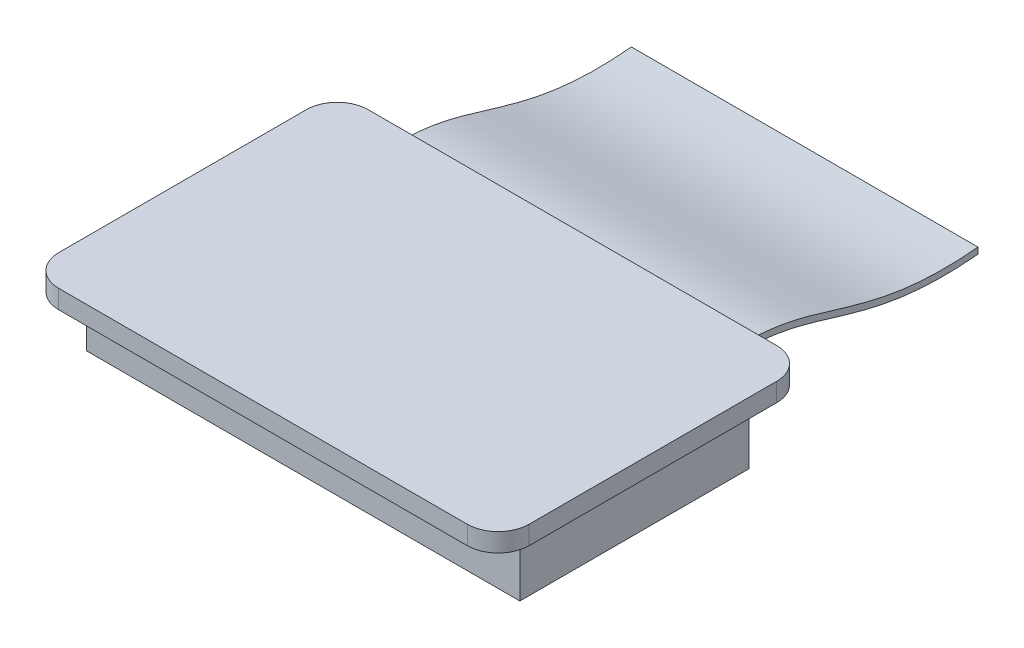
ISO-10303-21;
HEADER;
FILE_DESCRIPTION(('STEP AP214'),'2;1');
FILE_NAME('part.step','',(''),(''),'','','');
FILE_SCHEMA(('AUTOMOTIVE_DESIGN { 1 0 10303 214 1 1 1 1 }'));
ENDSEC;
DATA;
#1=APPLICATION_CONTEXT('core data for automotive mechanical design processes');
#2=APPLICATION_PROTOCOL_DEFINITION('international standard','automotive_design',2000,#1);
#3=PRODUCT_CONTEXT('',#1,'mechanical');
#4=PRODUCT('Part','Part','',(#3));
#5=PRODUCT_RELATED_PRODUCT_CATEGORY('part','',(#4));
#6=PRODUCT_DEFINITION_FORMATION('','',#4);
#7=PRODUCT_DEFINITION_CONTEXT('part definition',#1,'design');
#8=PRODUCT_DEFINITION('design','',#6,#7);
#9=PRODUCT_DEFINITION_SHAPE('','',#8);
#10=(LENGTH_UNIT() NAMED_UNIT(*) SI_UNIT(.MILLI.,.METRE.));
#11=(NAMED_UNIT(*) PLANE_ANGLE_UNIT() SI_UNIT($,.RADIAN.));
#12=(NAMED_UNIT(*) SI_UNIT($,.STERADIAN.) SOLID_ANGLE_UNIT());
#13=UNCERTAINTY_MEASURE_WITH_UNIT(LENGTH_MEASURE(1.E-05),#10,'distance_accuracy_value','');
#14=(GEOMETRIC_REPRESENTATION_CONTEXT(3) GLOBAL_UNCERTAINTY_ASSIGNED_CONTEXT((#13)) GLOBAL_UNIT_ASSIGNED_CONTEXT((#10,
#11,#12)) REPRESENTATION_CONTEXT('',''));
#15=CARTESIAN_POINT('',(0.,0.,0.));
#16=DIRECTION('',(0.,0.,1.));
#17=DIRECTION('',(1.,0.,0.));
#18=AXIS2_PLACEMENT_3D('',#15,#16,#17);
#19=CARTESIAN_POINT('',(3.3,0.748301222298696,8.25169585037883));
#20=DIRECTION('',(0.,-1.,0.));
#21=DIRECTION('',(0.,0.,-1.));
#22=AXIS2_PLACEMENT_3D('',#19,#20,#21);
#23=CYLINDRICAL_SURFACE('',#22,0.5);
#24=CARTESIAN_POINT('',(3.3,0.448301222298696,8.25169585037883));
#25=DIRECTION('',(0.,-1.,0.));
#26=DIRECTION('',(0.,0.,-1.));
#27=AXIS2_PLACEMENT_3D('',#24,#25,#26);
#28=CIRCLE('',#27,0.5);
#29=CARTESIAN_POINT('',(3.3,0.448301222298696,7.75169585037883));
#30=VERTEX_POINT('',#29);
#31=CARTESIAN_POINT('',(3.8,0.448301222298696,8.25169585037883));
#32=VERTEX_POINT('',#31);
#33=EDGE_CURVE('E170',#30,#32,#28,.T.);
#34=ORIENTED_EDGE('',*,*,#33,.F.);
#35=DIRECTION('',(0.,-1.,0.));
#36=VECTOR('',#35,1.);
#37=CARTESIAN_POINT('',(3.3,0.748301222298696,7.75169585037883));
#38=LINE('',#37,#36);
#39=CARTESIAN_POINT('',(3.3,0.748301222298696,7.75169585037883));
#40=VERTEX_POINT('',#39);
#41=EDGE_CURVE('E13',#40,#30,#38,.T.);
#42=ORIENTED_EDGE('',*,*,#41,.F.);
#43=CARTESIAN_POINT('',(3.3,0.748301222298696,8.25169585037883));
#44=DIRECTION('',(0.,-1.,0.));
#45=DIRECTION('',(0.,0.,-1.));
#46=AXIS2_PLACEMENT_3D('',#43,#44,#45);
#47=CIRCLE('',#46,0.5);
#48=CARTESIAN_POINT('',(3.8,0.748301222298696,8.25169585037883));
#49=VERTEX_POINT('',#48);
#50=EDGE_CURVE('E191',#40,#49,#47,.T.);
#51=ORIENTED_EDGE('',*,*,#50,.T.);
#52=DIRECTION('',(0.,-1.,0.));
#53=VECTOR('',#52,1.);
#54=CARTESIAN_POINT('',(3.8,0.748301222298696,8.25169585037883));
#55=LINE('',#54,#53);
#56=EDGE_CURVE('E63',#49,#32,#55,.T.);
#57=ORIENTED_EDGE('',*,*,#56,.T.);
#58=EDGE_LOOP('',(#34,#42,#51,#57));
#59=FACE_BOUND('',#58,.T.);
#60=ADVANCED_FACE('F60',(#59),#23,.T.);
#61=CARTESIAN_POINT('',(-3.3,0.748301222298696,7.75169585037883));
#62=DIRECTION('',(0.,0.,-1.));
#63=DIRECTION('',(-1.,0.,0.));
#64=AXIS2_PLACEMENT_3D('',#61,#62,#63);
#65=PLANE('',#64);
#66=DIRECTION('',(1.,0.,0.));
#67=VECTOR('',#66,1.);
#68=CARTESIAN_POINT('',(-3.3,0.448301222298696,7.75169585037883));
#69=LINE('',#68,#67);
#70=CARTESIAN_POINT('',(-3.3,0.448301222298696,7.75169585037883));
#71=VERTEX_POINT('',#70);
#72=EDGE_CURVE('E189',#71,#30,#69,.T.);
#73=ORIENTED_EDGE('',*,*,#72,.F.);
#74=DIRECTION('',(0.,-1.,0.));
#75=VECTOR('',#74,1.);
#76=CARTESIAN_POINT('',(-3.3,0.748301222298696,7.75169585037883));
#77=LINE('',#76,#75);
#78=CARTESIAN_POINT('',(-3.3,0.748301222298696,7.75169585037883));
#79=VERTEX_POINT('',#78);
#80=EDGE_CURVE('E68',#79,#71,#77,.T.);
#81=ORIENTED_EDGE('',*,*,#80,.F.);
#82=DIRECTION('',(1.,0.,0.));
#83=VECTOR('',#82,1.);
#84=CARTESIAN_POINT('',(-3.3,0.748301222298696,7.75169585037883));
#85=LINE('',#84,#83);
#86=EDGE_CURVE('E160',#79,#40,#85,.T.);
#87=ORIENTED_EDGE('',*,*,#86,.T.);
#88=ORIENTED_EDGE('',*,*,#41,.T.);
#89=EDGE_LOOP('',(#73,#81,#87,#88));
#90=FACE_BOUND('',#89,.T.);
#91=ADVANCED_FACE('F203',(#90),#65,.T.);
#92=CARTESIAN_POINT('',(-3.3,0.748301222298696,8.25169585037883));
#93=DIRECTION('',(0.,-1.,0.));
#94=DIRECTION('',(0.,0.,-1.));
#95=AXIS2_PLACEMENT_3D('',#92,#93,#94);
#96=CYLINDRICAL_SURFACE('',#95,0.5);
#97=CARTESIAN_POINT('',(-3.3,0.448301222298696,8.25169585037883));
#98=DIRECTION('',(0.,-1.,0.));
#99=DIRECTION('',(0.,0.,-1.));
#100=AXIS2_PLACEMENT_3D('',#97,#98,#99);
#101=CIRCLE('',#100,0.5);
#102=CARTESIAN_POINT('',(-3.8,0.448301222298696,8.25169585037883));
#103=VERTEX_POINT('',#102);
#104=EDGE_CURVE('E147',#103,#71,#101,.T.);
#105=ORIENTED_EDGE('',*,*,#104,.F.);
#106=DIRECTION('',(0.,-1.,0.));
#107=VECTOR('',#106,1.);
#108=CARTESIAN_POINT('',(-3.8,0.748301222298696,8.25169585037883));
#109=LINE('',#108,#107);
#110=CARTESIAN_POINT('',(-3.8,0.748301222298696,8.25169585037883));
#111=VERTEX_POINT('',#110);
#112=EDGE_CURVE('E141',#111,#103,#109,.T.);
#113=ORIENTED_EDGE('',*,*,#112,.F.);
#114=CARTESIAN_POINT('',(-3.3,0.748301222298696,8.25169585037883));
#115=DIRECTION('',(0.,-1.,0.));
#116=DIRECTION('',(0.,0.,-1.));
#117=AXIS2_PLACEMENT_3D('',#114,#115,#116);
#118=CIRCLE('',#117,0.5);
#119=EDGE_CURVE('E144',#111,#79,#118,.T.);
#120=ORIENTED_EDGE('',*,*,#119,.T.);
#121=ORIENTED_EDGE('',*,*,#80,.T.);
#122=EDGE_LOOP('',(#105,#113,#120,#121));
#123=FACE_BOUND('',#122,.T.);
#124=ADVANCED_FACE('F143',(#123),#96,.T.);
#125=CARTESIAN_POINT('',(-3.8,0.748301222298696,12.2516958503788));
#126=DIRECTION('',(-1.,0.,0.));
#127=DIRECTION('',(0.,0.,1.));
#128=AXIS2_PLACEMENT_3D('',#125,#126,#127);
#129=PLANE('',#128);
#130=DIRECTION('',(0.,0.,-1.));
#131=VECTOR('',#130,1.);
#132=CARTESIAN_POINT('',(-3.8,0.448301222298696,12.2516958503788));
#133=LINE('',#132,#131);
#134=CARTESIAN_POINT('',(-3.8,0.448301222298696,12.2516958503788));
#135=VERTEX_POINT('',#134);
#136=EDGE_CURVE('E186',#135,#103,#133,.T.);
#137=ORIENTED_EDGE('',*,*,#136,.F.);
#138=DIRECTION('',(0.,-1.,0.));
#139=VECTOR('',#138,1.);
#140=CARTESIAN_POINT('',(-3.8,0.748301222298696,12.2516958503788));
#141=LINE('',#140,#139);
#142=CARTESIAN_POINT('',(-3.8,0.748301222298696,12.2516958503788));
#143=VERTEX_POINT('',#142);
#144=EDGE_CURVE('E152',#143,#135,#141,.T.);
#145=ORIENTED_EDGE('',*,*,#144,.F.);
#146=DIRECTION('',(0.,0.,-1.));
#147=VECTOR('',#146,1.);
#148=CARTESIAN_POINT('',(-3.8,0.748301222298696,12.2516958503788));
#149=LINE('',#148,#147);
#150=EDGE_CURVE('E158',#143,#111,#149,.T.);
#151=ORIENTED_EDGE('',*,*,#150,.T.);
#152=ORIENTED_EDGE('',*,*,#112,.T.);
#153=EDGE_LOOP('',(#137,#145,#151,#152));
#154=FACE_BOUND('',#153,.T.);
#155=ADVANCED_FACE('F162',(#154),#129,.T.);
#156=CARTESIAN_POINT('',(-3.3,0.748301222298696,12.2516958503788));
#157=DIRECTION('',(0.,-1.,0.));
#158=DIRECTION('',(0.,0.,-1.));
#159=AXIS2_PLACEMENT_3D('',#156,#157,#158);
#160=CYLINDRICAL_SURFACE('',#159,0.5);
#161=CARTESIAN_POINT('',(-3.3,0.448301222298696,12.2516958503788));
#162=DIRECTION('',(0.,-1.,0.));
#163=DIRECTION('',(0.,0.,-1.));
#164=AXIS2_PLACEMENT_3D('',#161,#162,#163);
#165=CIRCLE('',#164,0.5);
#166=CARTESIAN_POINT('',(-3.3,0.448301222298696,12.7516958503788));
#167=VERTEX_POINT('',#166);
#168=EDGE_CURVE('E183',#167,#135,#165,.T.);
#169=ORIENTED_EDGE('',*,*,#168,.F.);
#170=DIRECTION('',(0.,-1.,0.));
#171=VECTOR('',#170,1.);
#172=CARTESIAN_POINT('',(-3.3,0.748301222298696,12.7516958503788));
#173=LINE('',#172,#171);
#174=CARTESIAN_POINT('',(-3.3,0.748301222298696,12.7516958503788));
#175=VERTEX_POINT('',#174);
#176=EDGE_CURVE('E195',#175,#167,#173,.T.);
#177=ORIENTED_EDGE('',*,*,#176,.F.);
#178=CARTESIAN_POINT('',(-3.3,0.748301222298696,12.2516958503788));
#179=DIRECTION('',(0.,-1.,0.));
#180=DIRECTION('',(0.,0.,-1.));
#181=AXIS2_PLACEMENT_3D('',#178,#179,#180);
#182=CIRCLE('',#181,0.5);
#183=EDGE_CURVE('E163',#175,#143,#182,.T.);
#184=ORIENTED_EDGE('',*,*,#183,.T.);
#185=ORIENTED_EDGE('',*,*,#144,.T.);
#186=EDGE_LOOP('',(#169,#177,#184,#185));
#187=FACE_BOUND('',#186,.T.);
#188=ADVANCED_FACE('F216',(#187),#160,.T.);
#189=CARTESIAN_POINT('',(-3.3,0.748301222298696,12.7516958503788));
#190=DIRECTION('',(0.,0.,1.));
#191=DIRECTION('',(1.,0.,0.));
#192=AXIS2_PLACEMENT_3D('',#189,#190,#191);
#193=PLANE('',#192);
#194=DIRECTION('',(-1.,0.,0.));
#195=VECTOR('',#194,1.);
#196=CARTESIAN_POINT('',(-3.3,0.448301222298696,12.7516958503788));
#197=LINE('',#196,#195);
#198=CARTESIAN_POINT('',(3.3,0.448301222298696,12.7516958503788));
#199=VERTEX_POINT('',#198);
#200=EDGE_CURVE('E180',#199,#167,#197,.T.);
#201=ORIENTED_EDGE('',*,*,#200,.F.);
#202=DIRECTION('',(0.,-1.,0.));
#203=VECTOR('',#202,1.);
#204=CARTESIAN_POINT('',(3.3,0.748301222298696,12.7516958503788));
#205=LINE('',#204,#203);
#206=CARTESIAN_POINT('',(3.3,0.748301222298696,12.7516958503788));
#207=VERTEX_POINT('',#206);
#208=EDGE_CURVE('E197',#207,#199,#205,.T.);
#209=ORIENTED_EDGE('',*,*,#208,.F.);
#210=DIRECTION('',(-1.,0.,0.));
#211=VECTOR('',#210,1.);
#212=CARTESIAN_POINT('',(-3.3,0.748301222298696,12.7516958503788));
#213=LINE('',#212,#211);
#214=EDGE_CURVE('E165',#207,#175,#213,.T.);
#215=ORIENTED_EDGE('',*,*,#214,.T.);
#216=ORIENTED_EDGE('',*,*,#176,.T.);
#217=EDGE_LOOP('',(#201,#209,#215,#216));
#218=FACE_BOUND('',#217,.T.);
#219=ADVANCED_FACE('F219',(#218),#193,.T.);
#220=CARTESIAN_POINT('',(3.3,0.748301222298696,12.2516958503788));
#221=DIRECTION('',(0.,-1.,0.));
#222=DIRECTION('',(0.,0.,-1.));
#223=AXIS2_PLACEMENT_3D('',#220,#221,#222);
#224=CYLINDRICAL_SURFACE('',#223,0.5);
#225=CARTESIAN_POINT('',(3.3,0.448301222298696,12.2516958503788));
#226=DIRECTION('',(0.,-1.,0.));
#227=DIRECTION('',(0.,0.,1.));
#228=AXIS2_PLACEMENT_3D('',#225,#226,#227);
#229=CIRCLE('',#228,0.5);
#230=CARTESIAN_POINT('',(3.8,0.448301222298696,12.2516958503788));
#231=VERTEX_POINT('',#230);
#232=EDGE_CURVE('E177',#231,#199,#229,.T.);
#233=ORIENTED_EDGE('',*,*,#232,.F.);
#234=DIRECTION('',(0.,-1.,0.));
#235=VECTOR('',#234,1.);
#236=CARTESIAN_POINT('',(3.8,0.748301222298696,12.2516958503788));
#237=LINE('',#236,#235);
#238=CARTESIAN_POINT('',(3.8,0.748301222298696,12.2516958503788));
#239=VERTEX_POINT('',#238);
#240=EDGE_CURVE('E198',#239,#231,#237,.T.);
#241=ORIENTED_EDGE('',*,*,#240,.F.);
#242=CARTESIAN_POINT('',(3.3,0.748301222298696,12.2516958503788));
#243=DIRECTION('',(0.,-1.,0.));
#244=DIRECTION('',(0.,0.,1.));
#245=AXIS2_PLACEMENT_3D('',#242,#243,#244);
#246=CIRCLE('',#245,0.5);
#247=EDGE_CURVE('E287',#239,#207,#246,.T.);
#248=ORIENTED_EDGE('',*,*,#247,.T.);
#249=ORIENTED_EDGE('',*,*,#208,.T.);
#250=EDGE_LOOP('',(#233,#241,#248,#249));
#251=FACE_BOUND('',#250,.T.);
#252=ADVANCED_FACE('F223',(#251),#224,.T.);
#253=CARTESIAN_POINT('',(3.8,0.748301222298696,12.2516958503788));
#254=DIRECTION('',(1.,0.,0.));
#255=DIRECTION('',(0.,0.,-1.));
#256=AXIS2_PLACEMENT_3D('',#253,#254,#255);
#257=PLANE('',#256);
#258=DIRECTION('',(0.,0.,1.));
#259=VECTOR('',#258,1.);
#260=CARTESIAN_POINT('',(3.8,0.448301222298696,12.2516958503788));
#261=LINE('',#260,#259);
#262=EDGE_CURVE('E173',#32,#231,#261,.T.);
#263=ORIENTED_EDGE('',*,*,#262,.F.);
#264=ORIENTED_EDGE('',*,*,#56,.F.);
#265=DIRECTION('',(0.,0.,1.));
#266=VECTOR('',#265,1.);
#267=CARTESIAN_POINT('',(3.8,0.748301222298696,12.2516958503788));
#268=LINE('',#267,#266);
#269=EDGE_CURVE('E285',#49,#239,#268,.T.);
#270=ORIENTED_EDGE('',*,*,#269,.T.);
#271=ORIENTED_EDGE('',*,*,#240,.T.);
#272=EDGE_LOOP('',(#263,#264,#270,#271));
#273=FACE_BOUND('',#272,.T.);
#274=ADVANCED_FACE('F200',(#273),#257,.T.);
#275=CARTESIAN_POINT('',(3.3,0.748301222298696,8.25169585037883));
#276=DIRECTION('',(0.,-1.,0.));
#277=DIRECTION('',(0.,0.,-1.));
#278=AXIS2_PLACEMENT_3D('',#275,#276,#277);
#279=PLANE('',#278);
#280=ORIENTED_EDGE('',*,*,#50,.F.);
#281=ORIENTED_EDGE('',*,*,#86,.F.);
#282=ORIENTED_EDGE('',*,*,#119,.F.);
#283=ORIENTED_EDGE('',*,*,#150,.F.);
#284=ORIENTED_EDGE('',*,*,#183,.F.);
#285=ORIENTED_EDGE('',*,*,#214,.F.);
#286=ORIENTED_EDGE('',*,*,#247,.F.);
#287=ORIENTED_EDGE('',*,*,#269,.F.);
#288=EDGE_LOOP('',(#280,#281,#282,#283,#284,#285,#286,#287));
#289=FACE_BOUND('',#288,.T.);
#290=ADVANCED_FACE('F156',(#289),#279,.F.);
#291=CARTESIAN_POINT('',(3.3,0.448301222298696,8.25169585037883));
#292=DIRECTION('',(0.,-1.,0.));
#293=DIRECTION('',(0.,0.,-1.));
#294=AXIS2_PLACEMENT_3D('',#291,#292,#293);
#295=PLANE('',#294);
#296=DIRECTION('',(0.,0.,1.));
#297=VECTOR('',#296,1.);
#298=CARTESIAN_POINT('',(3.5,0.448301222298696,12.1016958503788));
#299=LINE('',#298,#297);
#300=CARTESIAN_POINT('',(3.5,0.448301222298696,8.40169585037883));
#301=VERTEX_POINT('',#300);
#302=CARTESIAN_POINT('',(3.5,0.448301222298696,12.1016958503788));
#303=VERTEX_POINT('',#302);
#304=EDGE_CURVE('E269',#301,#303,#299,.T.);
#305=ORIENTED_EDGE('',*,*,#304,.F.);
#306=DIRECTION('',(-1.,0.,0.));
#307=VECTOR('',#306,1.);
#308=CARTESIAN_POINT('',(3.5,0.448301222298696,8.40169585037883));
#309=LINE('',#308,#307);
#310=CARTESIAN_POINT('',(-3.5,0.448301222298696,8.40169585037883));
#311=VERTEX_POINT('',#310);
#312=EDGE_CURVE('E280',#301,#311,#309,.T.);
#313=ORIENTED_EDGE('',*,*,#312,.T.);
#314=DIRECTION('',(0.,0.,1.));
#315=VECTOR('',#314,1.);
#316=CARTESIAN_POINT('',(-3.5,0.448301222298696,12.1016958503788));
#317=LINE('',#316,#315);
#318=CARTESIAN_POINT('',(-3.5,0.448301222298696,12.1016958503788));
#319=VERTEX_POINT('',#318);
#320=EDGE_CURVE('E272',#311,#319,#317,.T.);
#321=ORIENTED_EDGE('',*,*,#320,.T.);
#322=DIRECTION('',(-1.,0.,0.));
#323=VECTOR('',#322,1.);
#324=CARTESIAN_POINT('',(3.5,0.448301222298696,12.1016958503788));
#325=LINE('',#324,#323);
#326=EDGE_CURVE('E296',#303,#319,#325,.T.);
#327=ORIENTED_EDGE('',*,*,#326,.F.);
#328=EDGE_LOOP('',(#305,#313,#321,#327));
#329=FACE_BOUND('',#328,.T.);
#330=ORIENTED_EDGE('',*,*,#33,.T.);
#331=ORIENTED_EDGE('',*,*,#262,.T.);
#332=ORIENTED_EDGE('',*,*,#232,.T.);
#333=ORIENTED_EDGE('',*,*,#200,.T.);
#334=ORIENTED_EDGE('',*,*,#168,.T.);
#335=ORIENTED_EDGE('',*,*,#136,.T.);
#336=ORIENTED_EDGE('',*,*,#104,.T.);
#337=ORIENTED_EDGE('',*,*,#72,.T.);
#338=EDGE_LOOP('',(#330,#331,#332,#333,#334,#335,#336,#337));
#339=FACE_BOUND('',#338,.T.);
#340=ADVANCED_FACE('F202',(#329,#339),#295,.T.);
#341=CARTESIAN_POINT('',(3.5,0.448301222298696,12.1016958503788));
#342=DIRECTION('',(0.,0.,-1.));
#343=DIRECTION('',(-1.,0.,0.));
#344=AXIS2_PLACEMENT_3D('',#341,#342,#343);
#345=PLANE('',#344);
#346=DIRECTION('',(0.,-1.,0.));
#347=VECTOR('',#346,1.);
#348=CARTESIAN_POINT('',(-3.5,0.448301222298696,12.1016958503788));
#349=LINE('',#348,#347);
#350=CARTESIAN_POINT('',(-3.5,-0.551698777701304,12.1016958503788));
#351=VERTEX_POINT('',#350);
#352=EDGE_CURVE('E76',#319,#351,#349,.T.);
#353=ORIENTED_EDGE('',*,*,#352,.T.);
#354=DIRECTION('',(-1.,0.,0.));
#355=VECTOR('',#354,1.);
#356=CARTESIAN_POINT('',(3.5,-0.551698777701304,12.1016958503788));
#357=LINE('',#356,#355);
#358=CARTESIAN_POINT('',(3.5,-0.551698777701304,12.1016958503788));
#359=VERTEX_POINT('',#358);
#360=EDGE_CURVE('E174',#359,#351,#357,.T.);
#361=ORIENTED_EDGE('',*,*,#360,.F.);
#362=DIRECTION('',(0.,-1.,0.));
#363=VECTOR('',#362,1.);
#364=CARTESIAN_POINT('',(3.5,0.448301222298696,12.1016958503788));
#365=LINE('',#364,#363);
#366=EDGE_CURVE('E261',#303,#359,#365,.T.);
#367=ORIENTED_EDGE('',*,*,#366,.F.);
#368=ORIENTED_EDGE('',*,*,#326,.T.);
#369=EDGE_LOOP('',(#353,#361,#367,#368));
#370=FACE_BOUND('',#369,.T.);
#371=ADVANCED_FACE('F234',(#370),#345,.F.);
#372=CARTESIAN_POINT('',(3.5,-0.551698777701304,12.1016958503788));
#373=DIRECTION('',(0.,1.,0.));
#374=DIRECTION('',(0.,0.,1.));
#375=AXIS2_PLACEMENT_3D('',#372,#373,#374);
#376=PLANE('',#375);
#377=DIRECTION('',(0.,0.,-1.));
#378=VECTOR('',#377,1.);
#379=CARTESIAN_POINT('',(-3.5,-0.551698777701304,12.1016958503788));
#380=LINE('',#379,#378);
#381=CARTESIAN_POINT('',(-3.5,-0.551698777701304,8.40169585037883));
#382=VERTEX_POINT('',#381);
#383=EDGE_CURVE('E303',#351,#382,#380,.T.);
#384=ORIENTED_EDGE('',*,*,#383,.T.);
#385=DIRECTION('',(-1.,0.,0.));
#386=VECTOR('',#385,1.);
#387=CARTESIAN_POINT('',(3.5,-0.551698777701304,8.40169585037883));
#388=LINE('',#387,#386);
#389=CARTESIAN_POINT('',(3.5,-0.551698777701304,8.40169585037883));
#390=VERTEX_POINT('',#389);
#391=EDGE_CURVE('E277',#390,#382,#388,.T.);
#392=ORIENTED_EDGE('',*,*,#391,.F.);
#393=DIRECTION('',(0.,0.,-1.));
#394=VECTOR('',#393,1.);
#395=CARTESIAN_POINT('',(3.5,-0.551698777701304,12.1016958503788));
#396=LINE('',#395,#394);
#397=EDGE_CURVE('E266',#359,#390,#396,.T.);
#398=ORIENTED_EDGE('',*,*,#397,.F.);
#399=ORIENTED_EDGE('',*,*,#360,.T.);
#400=EDGE_LOOP('',(#384,#392,#398,#399));
#401=FACE_BOUND('',#400,.T.);
#402=ADVANCED_FACE('F239',(#401),#376,.F.);
#403=CARTESIAN_POINT('',(3.5,0.448301222298696,8.40169585037883));
#404=DIRECTION('',(0.,0.,1.));
#405=DIRECTION('',(1.,0.,0.));
#406=AXIS2_PLACEMENT_3D('',#403,#404,#405);
#407=PLANE('',#406);
#408=DIRECTION('',(0.,1.,0.));
#409=VECTOR('',#408,1.);
#410=CARTESIAN_POINT('',(-3.5,0.448301222298696,8.40169585037883));
#411=LINE('',#410,#409);
#412=EDGE_CURVE('E300',#382,#311,#411,.T.);
#413=ORIENTED_EDGE('',*,*,#412,.T.);
#414=ORIENTED_EDGE('',*,*,#312,.F.);
#415=DIRECTION('',(0.,1.,0.));
#416=VECTOR('',#415,1.);
#417=CARTESIAN_POINT('',(3.5,0.448301222298696,8.40169585037883));
#418=LINE('',#417,#416);
#419=EDGE_CURVE('E307',#390,#301,#418,.T.);
#420=ORIENTED_EDGE('',*,*,#419,.F.);
#421=ORIENTED_EDGE('',*,*,#391,.T.);
#422=EDGE_LOOP('',(#413,#414,#420,#421));
#423=FACE_BOUND('',#422,.T.);
#424=ADVANCED_FACE('F243',(#423),#407,.F.);
#425=CARTESIAN_POINT('',(3.5,0.,0.));
#426=DIRECTION('',(1.,0.,0.));
#427=DIRECTION('',(0.,0.,-1.));
#428=AXIS2_PLACEMENT_3D('',#425,#426,#427);
#429=PLANE('',#428);
#430=ORIENTED_EDGE('',*,*,#366,.T.);
#431=ORIENTED_EDGE('',*,*,#397,.T.);
#432=ORIENTED_EDGE('',*,*,#419,.T.);
#433=ORIENTED_EDGE('',*,*,#304,.T.);
#434=EDGE_LOOP('',(#430,#431,#432,#433));
#435=FACE_BOUND('',#434,.T.);
#436=ADVANCED_FACE('F247',(#435),#429,.T.);
#437=CARTESIAN_POINT('',(-3.5,0.,0.));
#438=DIRECTION('',(1.,0.,0.));
#439=DIRECTION('',(0.,0.,-1.));
#440=AXIS2_PLACEMENT_3D('',#437,#438,#439);
#441=PLANE('',#440);
#442=ORIENTED_EDGE('',*,*,#352,.F.);
#443=ORIENTED_EDGE('',*,*,#320,.F.);
#444=ORIENTED_EDGE('',*,*,#412,.F.);
#445=ORIENTED_EDGE('',*,*,#383,.F.);
#446=EDGE_LOOP('',(#442,#443,#444,#445));
#447=FACE_BOUND('',#446,.T.);
#448=ADVANCED_FACE('F249',(#447),#441,.F.);
#449=CLOSED_SHELL('',(#60,#91,#124,#155,#188,#219,#252,#274,#290,#340,#371,#402,#424,#436,#448));
#450=MANIFOLD_SOLID_BREP('B2',#449);
#451=CARTESIAN_POINT('',(0.,0.547843022465263,7.7421339457778));
#452=DIRECTION('',(0.,0.0956190460103406,0.995418001665669));
#453=DIRECTION('',(1.,0.,0.));
#454=AXIS2_PLACEMENT_3D('',#451,#452,#453);
#455=PLANE('',#454);
#456=DIRECTION('',(0.,-0.995418001665668,0.0956190460103406));
#457=VECTOR('',#456,1.);
#458=CARTESIAN_POINT('',(-2.8,0.547843022465263,7.7421339457778));
#459=LINE('',#458,#457);
#460=CARTESIAN_POINT('',(-2.8,0.547843022465263,7.7421339457778));
#461=VERTEX_POINT('',#460);
#462=CARTESIAN_POINT('',(-2.8,0.448301222298696,7.75169585037883));
#463=VERTEX_POINT('',#462);
#464=EDGE_CURVE('E445',#461,#463,#459,.T.);
#465=ORIENTED_EDGE('',*,*,#464,.T.);
#466=DIRECTION('',(1.,0.,0.));
#467=VECTOR('',#466,1.);
#468=CARTESIAN_POINT('',(-2.8,0.448301222298696,7.75169585037883));
#469=LINE('',#468,#467);
#470=CARTESIAN_POINT('',(2.8,0.448301222298696,7.75169585037883));
#471=VERTEX_POINT('',#470);
#472=EDGE_CURVE('E451',#463,#471,#469,.T.);
#473=ORIENTED_EDGE('',*,*,#472,.T.);
#474=DIRECTION('',(0.,0.995418001665668,-0.0956190460103407));
#475=VECTOR('',#474,1.);
#476=CARTESIAN_POINT('',(2.8,0.547843022465264,7.7421339457778));
#477=LINE('',#476,#475);
#478=CARTESIAN_POINT('',(2.8,0.547843022465264,7.7421339457778));
#479=VERTEX_POINT('',#478);
#480=EDGE_CURVE('E446',#471,#479,#477,.T.);
#481=ORIENTED_EDGE('',*,*,#480,.T.);
#482=DIRECTION('',(-1.,0.,0.));
#483=VECTOR('',#482,1.);
#484=CARTESIAN_POINT('',(-2.8,0.547843022465263,7.7421339457778));
#485=LINE('',#484,#483);
#486=EDGE_CURVE('E406',#479,#461,#485,.T.);
#487=ORIENTED_EDGE('',*,*,#486,.T.);
#488=EDGE_LOOP('',(#465,#473,#481,#487));
#489=FACE_BOUND('',#488,.T.);
#490=ADVANCED_FACE('F402',(#489),#455,.T.);
#491=CARTESIAN_POINT('',(0.,0.,3.99999999999998));
#492=DIRECTION('',(0.,0.,1.));
#493=DIRECTION('',(1.,0.,0.));
#494=AXIS2_PLACEMENT_3D('',#491,#492,#493);
#495=PLANE('',#494);
#496=DIRECTION('',(0.,-1.,0.));
#497=VECTOR('',#496,1.);
#498=CARTESIAN_POINT('',(-2.8,0.,3.99999999999998));
#499=LINE('',#498,#497);
#500=CARTESIAN_POINT('',(-2.8,0.,3.99999999999998));
#501=VERTEX_POINT('',#500);
#502=CARTESIAN_POINT('',(-2.8,-0.0999999999999998,3.99999999999998));
#503=VERTEX_POINT('',#502);
#504=EDGE_CURVE('E455',#501,#503,#499,.T.);
#505=ORIENTED_EDGE('',*,*,#504,.F.);
#506=DIRECTION('',(-1.,0.,0.));
#507=VECTOR('',#506,1.);
#508=CARTESIAN_POINT('',(-2.8,0.,3.99999999999998));
#509=LINE('',#508,#507);
#510=CARTESIAN_POINT('',(2.8,0.,3.99999999999998));
#511=VERTEX_POINT('',#510);
#512=EDGE_CURVE('E58',#511,#501,#509,.T.);
#513=ORIENTED_EDGE('',*,*,#512,.F.);
#514=DIRECTION('',(0.,1.,0.));
#515=VECTOR('',#514,1.);
#516=CARTESIAN_POINT('',(2.8,0.,3.99999999999998));
#517=LINE('',#516,#515);
#518=CARTESIAN_POINT('',(2.8,-0.0999999999999998,3.99999999999998));
#519=VERTEX_POINT('',#518);
#520=EDGE_CURVE('E412',#519,#511,#517,.T.);
#521=ORIENTED_EDGE('',*,*,#520,.F.);
#522=DIRECTION('',(1.,0.,0.));
#523=VECTOR('',#522,1.);
#524=CARTESIAN_POINT('',(-2.8,-0.0999999999999998,3.99999999999998));
#525=LINE('',#524,#523);
#526=EDGE_CURVE('E457',#503,#519,#525,.T.);
#527=ORIENTED_EDGE('',*,*,#526,.F.);
#528=EDGE_LOOP('',(#505,#513,#521,#527));
#529=FACE_BOUND('',#528,.T.);
#530=ADVANCED_FACE('F495',(#529),#495,.F.);
#531=CARTESIAN_POINT('',(2.8,0.,3.99999999999998));
#532=CARTESIAN_POINT('',(2.8,-0.024628468128532,4.25638846601688));
#533=CARTESIAN_POINT('',(2.8,-0.0386180157529813,4.72259081002346));
#534=CARTESIAN_POINT('',(2.8,0.0194715301087125,5.3120111853385));
#535=CARTESIAN_POINT('',(2.8,0.129906644668738,5.82138904334296));
#536=CARTESIAN_POINT('',(2.8,0.291873769263778,6.3680270958267));
#537=CARTESIAN_POINT('',(2.8,0.477782991355757,6.96597559310497));
#538=CARTESIAN_POINT('',(2.8,0.547843022465264,7.46326880544397));
#539=CARTESIAN_POINT('',(2.8,0.547843022465264,7.74213394577779));
#540=CARTESIAN_POINT('',(-2.8,0.,3.99999999999998));
#541=CARTESIAN_POINT('',(-2.8,-0.0246284681285331,4.25638846601688));
#542=CARTESIAN_POINT('',(-2.8,-0.0386180157529824,4.72259081002346));
#543=CARTESIAN_POINT('',(-2.8,0.0194715301087115,5.3120111853385));
#544=CARTESIAN_POINT('',(-2.8,0.129906644668737,5.82138904334296));
#545=CARTESIAN_POINT('',(-2.8,0.291873769263777,6.3680270958267));
#546=CARTESIAN_POINT('',(-2.8,0.477782991355756,6.96597559310497));
#547=CARTESIAN_POINT('',(-2.8,0.547843022465263,7.46326880544397));
#548=CARTESIAN_POINT('',(-2.8,0.547843022465263,7.74213394577779));
#549=B_SPLINE_SURFACE_WITH_KNOTS('',1,3,((#531,#532,#533,#534,#535,#536,#537,#538,#539),(#540,
#541,#542,#543,#544,#545,#546,#547,#548)),.UNSPECIFIED.,.F.,.F.,.F.,(2,2),(4,1,1,1,1,1,4),
(0.508771929824561,1.),(0.,0.14,0.28,0.42,0.559999999997895,0.780000000000162,1.),.UNSPECIFIED.);
#550=CARTESIAN_POINT('',(-2.8,0.,3.99999999999998));
#551=CARTESIAN_POINT('',(-2.8,-0.0246284681285331,4.25638846601688));
#552=CARTESIAN_POINT('',(-2.8,-0.0386180157529824,4.72259081002346));
#553=CARTESIAN_POINT('',(-2.8,0.0194715301087115,5.3120111853385));
#554=CARTESIAN_POINT('',(-2.8,0.129906644668737,5.82138904334296));
#555=CARTESIAN_POINT('',(-2.8,0.291873769263777,6.3680270958267));
#556=CARTESIAN_POINT('',(-2.8,0.477782991355756,6.96597559310497));
#557=CARTESIAN_POINT('',(-2.8,0.547843022465263,7.46326880544397));
#558=CARTESIAN_POINT('',(-2.8,0.547843022465263,7.74213394577779));
#559=B_SPLINE_CURVE_WITH_KNOTS('',3,(#550,#551,#552,#553,#554,#555,#556,#557,#558),
.UNSPECIFIED.,.F.,.F.,(4,1,1,1,1,1,4),(0.,0.14,0.28,0.42,0.559999999997895,0.780000000000162,
1.),.UNSPECIFIED.);
#560=EDGE_CURVE('E421',#501,#461,#559,.T.);
#561=CARTESIAN_POINT('',(2.8,0.,3.99999999999998));
#562=CARTESIAN_POINT('',(2.8,-0.024628468128532,4.25638846601688));
#563=CARTESIAN_POINT('',(2.8,-0.0386180157529813,4.72259081002346));
#564=CARTESIAN_POINT('',(2.8,0.0194715301087125,5.3120111853385));
#565=CARTESIAN_POINT('',(2.8,0.129906644668738,5.82138904334296));
#566=CARTESIAN_POINT('',(2.8,0.291873769263778,6.3680270958267));
#567=CARTESIAN_POINT('',(2.8,0.477782991355757,6.96597559310497));
#568=CARTESIAN_POINT('',(2.8,0.547843022465264,7.46326880544397));
#569=CARTESIAN_POINT('',(2.8,0.547843022465264,7.74213394577779));
#570=B_SPLINE_CURVE_WITH_KNOTS('',3,(#561,#562,#563,#564,#565,#566,#567,#568,#569),
.UNSPECIFIED.,.F.,.F.,(4,1,1,1,1,1,4),(0.,0.14,0.28,0.42,0.559999999997895,0.780000000000162,
1.),.UNSPECIFIED.);
#571=EDGE_CURVE('E438',#511,#479,#570,.T.);
#572=ORIENTED_EDGE('',*,*,#512,.T.);
#573=ORIENTED_EDGE('',*,*,#560,.T.);
#574=ORIENTED_EDGE('',*,*,#486,.F.);
#575=ORIENTED_EDGE('',*,*,#571,.F.);
#576=EDGE_LOOP('',(#572,#573,#574,#575));
#577=FACE_BOUND('',#576,.T.);
#578=ADVANCED_FACE('F453',(#577),#549,.T.);
#579=CARTESIAN_POINT('',(2.8,-0.0999999999999998,3.99999999999998));
#580=DIRECTION('',(1.,0.,0.));
#581=DIRECTION('',(0.,1.,0.));
#582=AXIS2_PLACEMENT_3D('',#579,#580,#581);
#583=PLANE('',#582);
#584=ORIENTED_EDGE('',*,*,#520,.T.);
#585=ORIENTED_EDGE('',*,*,#571,.T.);
#586=ORIENTED_EDGE('',*,*,#480,.F.);
#587=CARTESIAN_POINT('',(2.8,-0.0999999999999998,3.99999999999998));
#588=CARTESIAN_POINT('',(2.8,-0.124487822602086,4.2605128606233));
#589=CARTESIAN_POINT('',(2.8,-0.13819607917364,4.73496399384273));
#590=CARTESIAN_POINT('',(2.8,-0.0775684463145836,5.33705516657012));
#591=CARTESIAN_POINT('',(2.8,0.0359942616894102,5.85609097163903));
#592=CARTESIAN_POINT('',(2.8,0.200282397231649,6.40790162664091));
#593=CARTESIAN_POINT('',(2.8,0.38279321622902,6.99976726735009));
#594=CARTESIAN_POINT('',(2.8,0.449818563978634,7.48090729992634));
#595=CARTESIAN_POINT('',(2.8,0.448301222298696,7.75169585037883));
#596=B_SPLINE_CURVE_WITH_KNOTS('',3,(#587,#588,#589,#590,#591,#592,#593,#594,#595),
.UNSPECIFIED.,.F.,.F.,(4,1,1,1,1,1,4),(0.,0.14,0.28,0.42,0.559999999997895,0.780000000000162,
1.),.UNSPECIFIED.);
#597=EDGE_CURVE('E459',#519,#471,#596,.T.);
#598=ORIENTED_EDGE('',*,*,#597,.F.);
#599=EDGE_LOOP('',(#584,#585,#586,#598));
#600=FACE_BOUND('',#599,.T.);
#601=ADVANCED_FACE('F491',(#600),#583,.T.);
#602=CARTESIAN_POINT('',(-2.8,-0.0999999999999998,3.99999999999998));
#603=CARTESIAN_POINT('',(-2.8,-0.124487822602086,4.2605128606233));
#604=CARTESIAN_POINT('',(-2.8,-0.13819607917364,4.73496399384273));
#605=CARTESIAN_POINT('',(-2.8,-0.0775684463145836,5.33705516657012));
#606=CARTESIAN_POINT('',(-2.8,0.0359942616894102,5.85609097163903));
#607=CARTESIAN_POINT('',(-2.8,0.200282397231649,6.40790162664091));
#608=CARTESIAN_POINT('',(-2.8,0.38279321622902,6.99976726735009));
#609=CARTESIAN_POINT('',(-2.8,0.449818563978634,7.48090729992634));
#610=CARTESIAN_POINT('',(-2.8,0.448301222298696,7.75169585037883));
#611=CARTESIAN_POINT('',(2.8,-0.0999999999999998,3.99999999999998));
#612=CARTESIAN_POINT('',(2.8,-0.124487822602086,4.2605128606233));
#613=CARTESIAN_POINT('',(2.8,-0.13819607917364,4.73496399384273));
#614=CARTESIAN_POINT('',(2.8,-0.0775684463145836,5.33705516657012));
#615=CARTESIAN_POINT('',(2.8,0.0359942616894102,5.85609097163903));
#616=CARTESIAN_POINT('',(2.8,0.200282397231649,6.40790162664091));
#617=CARTESIAN_POINT('',(2.8,0.38279321622902,6.99976726735009));
#618=CARTESIAN_POINT('',(2.8,0.449818563978634,7.48090729992634));
#619=CARTESIAN_POINT('',(2.8,0.448301222298696,7.75169585037883));
#620=B_SPLINE_SURFACE_WITH_KNOTS('',1,3,((#602,#603,#604,#605,#606,#607,#608,#609,#610),(#611,
#612,#613,#614,#615,#616,#617,#618,#619)),.UNSPECIFIED.,.F.,.F.,.F.,(2,2),(4,1,1,1,1,1,4),
(0.00877192982456138,0.5),(0.,0.14,0.28,0.42,0.559999999997895,0.780000000000162,1.),.UNSPECIFIED.);
#621=CARTESIAN_POINT('',(-2.8,-0.0999999999999998,3.99999999999998));
#622=CARTESIAN_POINT('',(-2.8,-0.124487822602086,4.2605128606233));
#623=CARTESIAN_POINT('',(-2.8,-0.13819607917364,4.73496399384273));
#624=CARTESIAN_POINT('',(-2.8,-0.0775684463145836,5.33705516657012));
#625=CARTESIAN_POINT('',(-2.8,0.0359942616894102,5.85609097163903));
#626=CARTESIAN_POINT('',(-2.8,0.200282397231649,6.40790162664091));
#627=CARTESIAN_POINT('',(-2.8,0.38279321622902,6.99976726735009));
#628=CARTESIAN_POINT('',(-2.8,0.449818563978634,7.48090729992634));
#629=CARTESIAN_POINT('',(-2.8,0.448301222298696,7.75169585037883));
#630=B_SPLINE_CURVE_WITH_KNOTS('',3,(#621,#622,#623,#624,#625,#626,#627,#628,#629),
.UNSPECIFIED.,.F.,.F.,(4,1,1,1,1,1,4),(0.,0.14,0.28,0.42,0.559999999997895,0.780000000000162,
1.),.UNSPECIFIED.);
#631=EDGE_CURVE('E448',#503,#463,#630,.T.);
#632=ORIENTED_EDGE('',*,*,#526,.T.);
#633=ORIENTED_EDGE('',*,*,#597,.T.);
#634=ORIENTED_EDGE('',*,*,#472,.F.);
#635=ORIENTED_EDGE('',*,*,#631,.F.);
#636=EDGE_LOOP('',(#632,#633,#634,#635));
#637=FACE_BOUND('',#636,.T.);
#638=ADVANCED_FACE('F488',(#637),#620,.T.);
#639=CARTESIAN_POINT('',(-2.8,0.,3.99999999999998));
#640=DIRECTION('',(-1.,0.,0.));
#641=DIRECTION('',(0.,-1.,0.));
#642=AXIS2_PLACEMENT_3D('',#639,#640,#641);
#643=PLANE('',#642);
#644=ORIENTED_EDGE('',*,*,#504,.T.);
#645=ORIENTED_EDGE('',*,*,#631,.T.);
#646=ORIENTED_EDGE('',*,*,#464,.F.);
#647=ORIENTED_EDGE('',*,*,#560,.F.);
#648=EDGE_LOOP('',(#644,#645,#646,#647));
#649=FACE_BOUND('',#648,.T.);
#650=ADVANCED_FACE('F404',(#649),#643,.T.);
#651=CLOSED_SHELL('',(#490,#530,#578,#601,#638,#650));
#652=MANIFOLD_SOLID_BREP('B7',#651);
#653=ADVANCED_BREP_SHAPE_REPRESENTATION('',(#18,#450,#652),#14);
#654=SHAPE_DEFINITION_REPRESENTATION(#9,#653);
ENDSEC;
END-ISO-10303-21;
